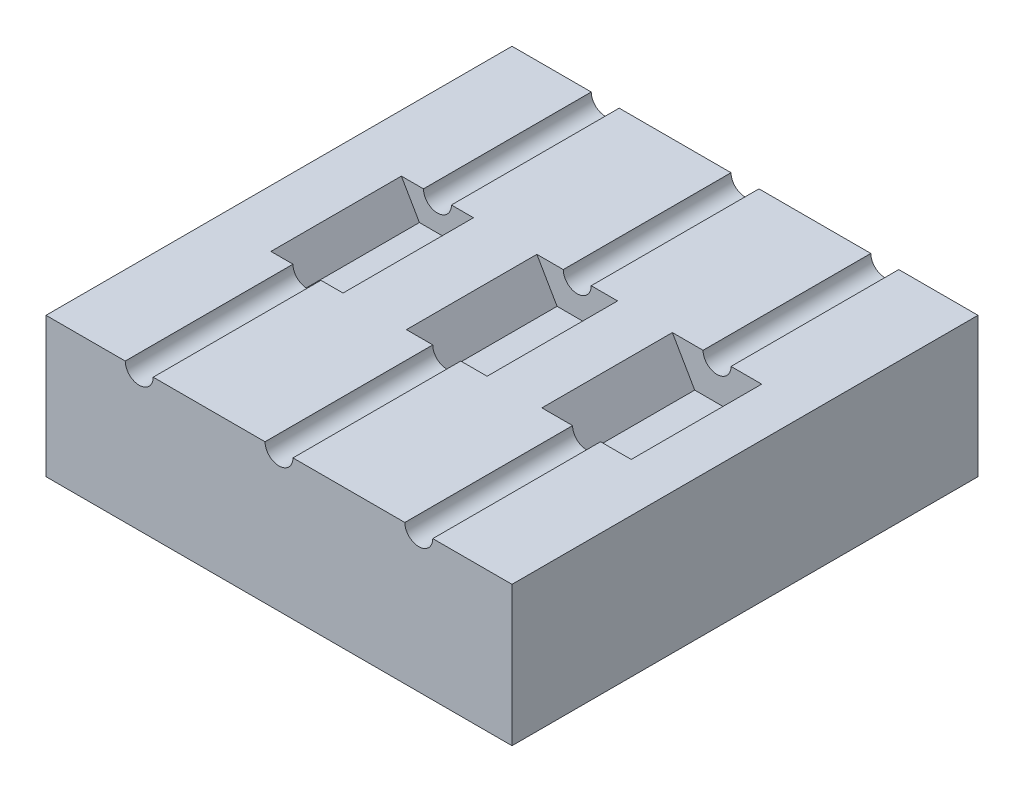
ISO-10303-21;
HEADER;
FILE_DESCRIPTION(('STEP AP214'),'2;1');
FILE_NAME('part.step','',(''),(''),'','','');
FILE_SCHEMA(('AUTOMOTIVE_DESIGN { 1 0 10303 214 1 1 1 1 }'));
ENDSEC;
DATA;
#1=APPLICATION_CONTEXT('core data for automotive mechanical design processes');
#2=APPLICATION_PROTOCOL_DEFINITION('international standard','automotive_design',2000,#1);
#3=PRODUCT_CONTEXT('',#1,'mechanical');
#4=PRODUCT('Part','Part','',(#3));
#5=PRODUCT_RELATED_PRODUCT_CATEGORY('part','',(#4));
#6=PRODUCT_DEFINITION_FORMATION('','',#4);
#7=PRODUCT_DEFINITION_CONTEXT('part definition',#1,'design');
#8=PRODUCT_DEFINITION('design','',#6,#7);
#9=PRODUCT_DEFINITION_SHAPE('','',#8);
#10=(LENGTH_UNIT() NAMED_UNIT(*) SI_UNIT(.MILLI.,.METRE.));
#11=(NAMED_UNIT(*) PLANE_ANGLE_UNIT() SI_UNIT($,.RADIAN.));
#12=(NAMED_UNIT(*) SI_UNIT($,.STERADIAN.) SOLID_ANGLE_UNIT());
#13=UNCERTAINTY_MEASURE_WITH_UNIT(LENGTH_MEASURE(1.E-05),#10,'distance_accuracy_value','');
#14=(GEOMETRIC_REPRESENTATION_CONTEXT(3) GLOBAL_UNCERTAINTY_ASSIGNED_CONTEXT((#13)) GLOBAL_UNIT_ASSIGNED_CONTEXT((#10,
#11,#12)) REPRESENTATION_CONTEXT('',''));
#15=CARTESIAN_POINT('',(0.,0.,0.));
#16=DIRECTION('',(0.,0.,1.));
#17=DIRECTION('',(1.,0.,0.));
#18=AXIS2_PLACEMENT_3D('',#15,#16,#17);
#19=CARTESIAN_POINT('',(0.,7.5,0.));
#20=DIRECTION('',(0.,-1.,0.));
#21=DIRECTION('',(0.,0.,-1.));
#22=AXIS2_PLACEMENT_3D('',#19,#20,#21);
#23=PLANE('',#22);
#24=DIRECTION('',(1.,0.,0.));
#25=VECTOR('',#24,1.);
#26=CARTESIAN_POINT('',(0.,7.5,0.));
#27=LINE('',#26,#25);
#28=CARTESIAN_POINT('',(0.,7.5,0.));
#29=VERTEX_POINT('',#28);
#30=CARTESIAN_POINT('',(4.25,7.5,0.));
#31=VERTEX_POINT('',#30);
#32=EDGE_CURVE('E239',#29,#31,#27,.T.);
#33=ORIENTED_EDGE('',*,*,#32,.T.);
#34=DIRECTION('',(0.,0.,-1.));
#35=VECTOR('',#34,1.);
#36=CARTESIAN_POINT('',(4.25,7.5,0.));
#37=LINE('',#36,#35);
#38=CARTESIAN_POINT('',(4.25,7.5,-9.));
#39=VERTEX_POINT('',#38);
#40=EDGE_CURVE('E221',#31,#39,#37,.T.);
#41=ORIENTED_EDGE('',*,*,#40,.T.);
#42=DIRECTION('',(-1.,0.,0.));
#43=VECTOR('',#42,1.);
#44=CARTESIAN_POINT('',(6.93412340178524,7.5,-9.));
#45=LINE('',#44,#43);
#46=CARTESIAN_POINT('',(3.06587659821476,7.5,-9.));
#47=VERTEX_POINT('',#46);
#48=EDGE_CURVE('E350',#39,#47,#45,.T.);
#49=ORIENTED_EDGE('',*,*,#48,.T.);
#50=DIRECTION('',(0.,0.,-1.));
#51=VECTOR('',#50,1.);
#52=CARTESIAN_POINT('',(3.06587659821476,7.5,-9.));
#53=LINE('',#52,#51);
#54=CARTESIAN_POINT('',(3.06587659821476,7.5,-16.));
#55=VERTEX_POINT('',#54);
#56=EDGE_CURVE('E336',#47,#55,#53,.T.);
#57=ORIENTED_EDGE('',*,*,#56,.T.);
#58=DIRECTION('',(-1.,0.,0.));
#59=VECTOR('',#58,1.);
#60=CARTESIAN_POINT('',(6.93412340178524,7.5,-16.));
#61=LINE('',#60,#59);
#62=CARTESIAN_POINT('',(4.25,7.5,-16.));
#63=VERTEX_POINT('',#62);
#64=EDGE_CURVE('E363',#63,#55,#61,.T.);
#65=ORIENTED_EDGE('',*,*,#64,.F.);
#66=CARTESIAN_POINT('',(4.25,7.5,-25.));
#67=VERTEX_POINT('',#66);
#68=EDGE_CURVE('E234',#63,#67,#37,.T.);
#69=ORIENTED_EDGE('',*,*,#68,.T.);
#70=DIRECTION('',(-1.,0.,0.));
#71=VECTOR('',#70,1.);
#72=CARTESIAN_POINT('',(0.,7.5,-25.));
#73=LINE('',#72,#71);
#74=CARTESIAN_POINT('',(0.,7.5,-25.));
#75=VERTEX_POINT('',#74);
#76=EDGE_CURVE('E252',#67,#75,#73,.T.);
#77=ORIENTED_EDGE('',*,*,#76,.T.);
#78=DIRECTION('',(0.,0.,1.));
#79=VECTOR('',#78,1.);
#80=CARTESIAN_POINT('',(0.,7.5,0.));
#81=LINE('',#80,#79);
#82=EDGE_CURVE('E247',#75,#29,#81,.T.);
#83=ORIENTED_EDGE('',*,*,#82,.T.);
#84=EDGE_LOOP('',(#33,#41,#49,#57,#65,#69,#77,#83));
#85=FACE_BOUND('',#84,.T.);
#86=ADVANCED_FACE('F38',(#85),#23,.F.);
#87=CARTESIAN_POINT('',(13.25,7.5,0.));
#88=VERTEX_POINT('',#87);
#89=CARTESIAN_POINT('',(19.25,7.5,0.));
#90=VERTEX_POINT('',#89);
#91=EDGE_CURVE('E254',#88,#90,#27,.T.);
#92=ORIENTED_EDGE('',*,*,#91,.T.);
#93=DIRECTION('',(0.,0.,-1.));
#94=VECTOR('',#93,1.);
#95=CARTESIAN_POINT('',(19.25,7.5,0.));
#96=LINE('',#95,#94);
#97=CARTESIAN_POINT('',(19.25,7.5,-9.));
#98=VERTEX_POINT('',#97);
#99=EDGE_CURVE('E298',#90,#98,#96,.T.);
#100=ORIENTED_EDGE('',*,*,#99,.T.);
#101=DIRECTION('',(-1.,0.,0.));
#102=VECTOR('',#101,1.);
#103=CARTESIAN_POINT('',(22.3960036171369,7.5,-9.));
#104=LINE('',#103,#102);
#105=CARTESIAN_POINT('',(17.6039963828631,7.5,-9.));
#106=VERTEX_POINT('',#105);
#107=EDGE_CURVE('E283',#98,#106,#104,.T.);
#108=ORIENTED_EDGE('',*,*,#107,.T.);
#109=DIRECTION('',(0.,0.,-1.));
#110=VECTOR('',#109,1.);
#111=CARTESIAN_POINT('',(17.6039963828631,7.5,-9.));
#112=LINE('',#111,#110);
#113=CARTESIAN_POINT('',(17.6039963828631,7.5,-16.));
#114=VERTEX_POINT('',#113);
#115=EDGE_CURVE('E292',#106,#114,#112,.T.);
#116=ORIENTED_EDGE('',*,*,#115,.T.);
#117=DIRECTION('',(-1.,0.,0.));
#118=VECTOR('',#117,1.);
#119=CARTESIAN_POINT('',(22.3960036171369,7.5,-16.));
#120=LINE('',#119,#118);
#121=CARTESIAN_POINT('',(19.25,7.5,-16.));
#122=VERTEX_POINT('',#121);
#123=EDGE_CURVE('E270',#122,#114,#120,.T.);
#124=ORIENTED_EDGE('',*,*,#123,.F.);
#125=CARTESIAN_POINT('',(19.25,7.5,-25.));
#126=VERTEX_POINT('',#125);
#127=EDGE_CURVE('E60',#122,#126,#96,.T.);
#128=ORIENTED_EDGE('',*,*,#127,.T.);
#129=CARTESIAN_POINT('',(13.25,7.5,-25.));
#130=VERTEX_POINT('',#129);
#131=EDGE_CURVE('E437',#126,#130,#73,.T.);
#132=ORIENTED_EDGE('',*,*,#131,.T.);
#133=DIRECTION('',(0.,0.,-1.));
#134=VECTOR('',#133,1.);
#135=CARTESIAN_POINT('',(13.25,7.5,0.));
#136=LINE('',#135,#134);
#137=CARTESIAN_POINT('',(13.25,7.5,-16.));
#138=VERTEX_POINT('',#137);
#139=EDGE_CURVE('E231',#130,#138,#136,.F.);
#140=ORIENTED_EDGE('',*,*,#139,.T.);
#141=DIRECTION('',(-1.,0.,0.));
#142=VECTOR('',#141,1.);
#143=CARTESIAN_POINT('',(14.6650635094611,7.5,-16.));
#144=LINE('',#143,#142);
#145=CARTESIAN_POINT('',(14.6650635094611,7.5,-16.));
#146=VERTEX_POINT('',#145);
#147=EDGE_CURVE('E302',#146,#138,#144,.T.);
#148=ORIENTED_EDGE('',*,*,#147,.F.);
#149=DIRECTION('',(0.,0.,-1.));
#150=VECTOR('',#149,1.);
#151=CARTESIAN_POINT('',(14.6650635094611,7.5,-9.));
#152=LINE('',#151,#150);
#153=CARTESIAN_POINT('',(14.6650635094611,7.5,-9.));
#154=VERTEX_POINT('',#153);
#155=EDGE_CURVE('E266',#154,#146,#152,.T.);
#156=ORIENTED_EDGE('',*,*,#155,.F.);
#157=DIRECTION('',(-1.,0.,0.));
#158=VECTOR('',#157,1.);
#159=CARTESIAN_POINT('',(14.6650635094611,7.5,-9.));
#160=LINE('',#159,#158);
#161=CARTESIAN_POINT('',(13.25,7.5,-9.));
#162=VERTEX_POINT('',#161);
#163=EDGE_CURVE('E315',#154,#162,#160,.T.);
#164=ORIENTED_EDGE('',*,*,#163,.T.);
#165=EDGE_CURVE('E375',#162,#88,#136,.F.);
#166=ORIENTED_EDGE('',*,*,#165,.T.);
#167=EDGE_LOOP('',(#92,#100,#108,#116,#124,#128,#132,#140,#148,#156,#164,#166));
#168=FACE_BOUND('',#167,.T.);
#169=ADVANCED_FACE('F399',(#168),#23,.F.);
#170=CARTESIAN_POINT('',(11.75,7.5,-25.));
#171=VERTEX_POINT('',#170);
#172=CARTESIAN_POINT('',(5.75,7.5,-25.));
#173=VERTEX_POINT('',#172);
#174=EDGE_CURVE('E428',#171,#173,#73,.T.);
#175=ORIENTED_EDGE('',*,*,#174,.T.);
#176=DIRECTION('',(0.,0.,-1.));
#177=VECTOR('',#176,1.);
#178=CARTESIAN_POINT('',(5.75,7.5,0.));
#179=LINE('',#178,#177);
#180=CARTESIAN_POINT('',(5.75,7.5,-16.));
#181=VERTEX_POINT('',#180);
#182=EDGE_CURVE('E383',#173,#181,#179,.F.);
#183=ORIENTED_EDGE('',*,*,#182,.T.);
#184=CARTESIAN_POINT('',(6.93412340178524,7.5,-16.));
#185=VERTEX_POINT('',#184);
#186=EDGE_CURVE('E360',#185,#181,#61,.T.);
#187=ORIENTED_EDGE('',*,*,#186,.F.);
#188=DIRECTION('',(0.,0.,-1.));
#189=VECTOR('',#188,1.);
#190=CARTESIAN_POINT('',(6.93412340178524,7.5,-9.));
#191=LINE('',#190,#189);
#192=CARTESIAN_POINT('',(6.93412340178524,7.5,-9.));
#193=VERTEX_POINT('',#192);
#194=EDGE_CURVE('E332',#193,#185,#191,.T.);
#195=ORIENTED_EDGE('',*,*,#194,.F.);
#196=CARTESIAN_POINT('',(5.75,7.5,-9.));
#197=VERTEX_POINT('',#196);
#198=EDGE_CURVE('E347',#193,#197,#45,.T.);
#199=ORIENTED_EDGE('',*,*,#198,.T.);
#200=CARTESIAN_POINT('',(5.75,7.5,0.));
#201=VERTEX_POINT('',#200);
#202=EDGE_CURVE('E232',#197,#201,#179,.F.);
#203=ORIENTED_EDGE('',*,*,#202,.T.);
#204=CARTESIAN_POINT('',(11.75,7.5,0.));
#205=VERTEX_POINT('',#204);
#206=EDGE_CURVE('E243',#201,#205,#27,.T.);
#207=ORIENTED_EDGE('',*,*,#206,.T.);
#208=DIRECTION('',(0.,0.,-1.));
#209=VECTOR('',#208,1.);
#210=CARTESIAN_POINT('',(11.75,7.5,0.));
#211=LINE('',#210,#209);
#212=CARTESIAN_POINT('',(11.75,7.5,-9.));
#213=VERTEX_POINT('',#212);
#214=EDGE_CURVE('E371',#205,#213,#211,.T.);
#215=ORIENTED_EDGE('',*,*,#214,.T.);
#216=CARTESIAN_POINT('',(10.3349364905389,7.5,-9.));
#217=VERTEX_POINT('',#216);
#218=EDGE_CURVE('E318',#213,#217,#160,.T.);
#219=ORIENTED_EDGE('',*,*,#218,.T.);
#220=DIRECTION('',(0.,0.,-1.));
#221=VECTOR('',#220,1.);
#222=CARTESIAN_POINT('',(10.3349364905389,7.5,-9.));
#223=LINE('',#222,#221);
#224=CARTESIAN_POINT('',(10.3349364905389,7.5,-16.));
#225=VERTEX_POINT('',#224);
#226=EDGE_CURVE('E327',#217,#225,#223,.T.);
#227=ORIENTED_EDGE('',*,*,#226,.T.);
#228=CARTESIAN_POINT('',(11.75,7.5,-16.));
#229=VERTEX_POINT('',#228);
#230=EDGE_CURVE('E305',#229,#225,#144,.T.);
#231=ORIENTED_EDGE('',*,*,#230,.F.);
#232=EDGE_CURVE('E376',#229,#171,#211,.T.);
#233=ORIENTED_EDGE('',*,*,#232,.T.);
#234=EDGE_LOOP('',(#175,#183,#187,#195,#199,#203,#207,#215,#219,#227,#231,#233));
#235=FACE_BOUND('',#234,.T.);
#236=ADVANCED_FACE('F407',(#235),#23,.F.);
#237=CARTESIAN_POINT('',(0.,7.5,0.));
#238=DIRECTION('',(1.,0.,0.));
#239=DIRECTION('',(0.,0.,-1.));
#240=AXIS2_PLACEMENT_3D('',#237,#238,#239);
#241=PLANE('',#240);
#242=DIRECTION('',(0.,0.,1.));
#243=VECTOR('',#242,1.);
#244=CARTESIAN_POINT('',(0.,0.,0.));
#245=LINE('',#244,#243);
#246=CARTESIAN_POINT('',(0.,0.,-25.));
#247=VERTEX_POINT('',#246);
#248=CARTESIAN_POINT('',(0.,0.,0.));
#249=VERTEX_POINT('',#248);
#250=EDGE_CURVE('E335',#247,#249,#245,.T.);
#251=ORIENTED_EDGE('',*,*,#250,.T.);
#252=DIRECTION('',(0.,-1.,0.));
#253=VECTOR('',#252,1.);
#254=CARTESIAN_POINT('',(0.,7.5,0.));
#255=LINE('',#254,#253);
#256=EDGE_CURVE('E456',#29,#249,#255,.T.);
#257=ORIENTED_EDGE('',*,*,#256,.F.);
#258=ORIENTED_EDGE('',*,*,#82,.F.);
#259=DIRECTION('',(0.,-1.,0.));
#260=VECTOR('',#259,1.);
#261=CARTESIAN_POINT('',(0.,7.5,-25.));
#262=LINE('',#261,#260);
#263=EDGE_CURVE('E442',#75,#247,#262,.T.);
#264=ORIENTED_EDGE('',*,*,#263,.T.);
#265=EDGE_LOOP('',(#251,#257,#258,#264));
#266=FACE_BOUND('',#265,.T.);
#267=ADVANCED_FACE('F40',(#266),#241,.F.);
#268=CARTESIAN_POINT('',(0.,7.5,0.));
#269=DIRECTION('',(0.,0.,-1.));
#270=DIRECTION('',(-1.,0.,0.));
#271=AXIS2_PLACEMENT_3D('',#268,#269,#270);
#272=PLANE('',#271);
#273=ORIENTED_EDGE('',*,*,#206,.F.);
#274=CARTESIAN_POINT('',(5.,7.5,0.));
#275=DIRECTION('',(0.,0.,-1.));
#276=DIRECTION('',(-1.,0.,0.));
#277=AXIS2_PLACEMENT_3D('',#274,#275,#276);
#278=CIRCLE('',#277,0.749999999999999);
#279=EDGE_CURVE('E224',#201,#31,#278,.T.);
#280=ORIENTED_EDGE('',*,*,#279,.T.);
#281=ORIENTED_EDGE('',*,*,#32,.F.);
#282=ORIENTED_EDGE('',*,*,#256,.T.);
#283=DIRECTION('',(1.,0.,0.));
#284=VECTOR('',#283,1.);
#285=CARTESIAN_POINT('',(0.,0.,0.));
#286=LINE('',#285,#284);
#287=CARTESIAN_POINT('',(25.,0.,0.));
#288=VERTEX_POINT('',#287);
#289=EDGE_CURVE('E445',#249,#288,#286,.T.);
#290=ORIENTED_EDGE('',*,*,#289,.T.);
#291=DIRECTION('',(0.,-1.,0.));
#292=VECTOR('',#291,1.);
#293=CARTESIAN_POINT('',(25.,7.5,0.));
#294=LINE('',#293,#292);
#295=CARTESIAN_POINT('',(25.,7.5,0.));
#296=VERTEX_POINT('',#295);
#297=EDGE_CURVE('E453',#296,#288,#294,.T.);
#298=ORIENTED_EDGE('',*,*,#297,.F.);
#299=CARTESIAN_POINT('',(20.75,7.5,0.));
#300=VERTEX_POINT('',#299);
#301=EDGE_CURVE('E251',#300,#296,#27,.T.);
#302=ORIENTED_EDGE('',*,*,#301,.F.);
#303=CARTESIAN_POINT('',(20.,7.5,0.));
#304=DIRECTION('',(0.,0.,-1.));
#305=DIRECTION('',(-1.,0.,0.));
#306=AXIS2_PLACEMENT_3D('',#303,#304,#305);
#307=CIRCLE('',#306,0.750000000000002);
#308=EDGE_CURVE('E391',#300,#90,#307,.T.);
#309=ORIENTED_EDGE('',*,*,#308,.T.);
#310=ORIENTED_EDGE('',*,*,#91,.F.);
#311=CARTESIAN_POINT('',(12.5,7.5,0.));
#312=DIRECTION('',(0.,0.,-1.));
#313=DIRECTION('',(-1.,0.,0.));
#314=AXIS2_PLACEMENT_3D('',#311,#312,#313);
#315=CIRCLE('',#314,0.75);
#316=EDGE_CURVE('E386',#88,#205,#315,.T.);
#317=ORIENTED_EDGE('',*,*,#316,.T.);
#318=EDGE_LOOP('',(#273,#280,#281,#282,#290,#298,#302,#309,#310,#317));
#319=FACE_BOUND('',#318,.T.);
#320=ADVANCED_FACE('F237',(#319),#272,.F.);
#321=CARTESIAN_POINT('',(25.,7.5,0.));
#322=DIRECTION('',(-1.,0.,0.));
#323=DIRECTION('',(0.,0.,1.));
#324=AXIS2_PLACEMENT_3D('',#321,#322,#323);
#325=PLANE('',#324);
#326=DIRECTION('',(0.,0.,-1.));
#327=VECTOR('',#326,1.);
#328=CARTESIAN_POINT('',(25.,0.,0.));
#329=LINE('',#328,#327);
#330=CARTESIAN_POINT('',(25.,0.,-25.));
#331=VERTEX_POINT('',#330);
#332=EDGE_CURVE('E261',#288,#331,#329,.T.);
#333=ORIENTED_EDGE('',*,*,#332,.T.);
#334=DIRECTION('',(0.,-1.,0.));
#335=VECTOR('',#334,1.);
#336=CARTESIAN_POINT('',(25.,7.5,-25.));
#337=LINE('',#336,#335);
#338=CARTESIAN_POINT('',(25.,7.5,-25.));
#339=VERTEX_POINT('',#338);
#340=EDGE_CURVE('E450',#339,#331,#337,.T.);
#341=ORIENTED_EDGE('',*,*,#340,.F.);
#342=DIRECTION('',(0.,0.,-1.));
#343=VECTOR('',#342,1.);
#344=CARTESIAN_POINT('',(25.,7.5,0.));
#345=LINE('',#344,#343);
#346=EDGE_CURVE('E249',#296,#339,#345,.T.);
#347=ORIENTED_EDGE('',*,*,#346,.F.);
#348=ORIENTED_EDGE('',*,*,#297,.T.);
#349=EDGE_LOOP('',(#333,#341,#347,#348));
#350=FACE_BOUND('',#349,.T.);
#351=ADVANCED_FACE('F469',(#350),#325,.F.);
#352=CARTESIAN_POINT('',(0.,7.5,-25.));
#353=DIRECTION('',(0.,0.,1.));
#354=DIRECTION('',(1.,0.,0.));
#355=AXIS2_PLACEMENT_3D('',#352,#353,#354);
#356=PLANE('',#355);
#357=ORIENTED_EDGE('',*,*,#76,.F.);
#358=CARTESIAN_POINT('',(5.,7.5,-25.));
#359=DIRECTION('',(0.,0.,-1.));
#360=DIRECTION('',(-1.,0.,0.));
#361=AXIS2_PLACEMENT_3D('',#358,#359,#360);
#362=CIRCLE('',#361,0.749999999999999);
#363=EDGE_CURVE('E244',#173,#67,#362,.T.);
#364=ORIENTED_EDGE('',*,*,#363,.F.);
#365=ORIENTED_EDGE('',*,*,#174,.F.);
#366=CARTESIAN_POINT('',(12.5,7.5,-25.));
#367=DIRECTION('',(0.,0.,-1.));
#368=DIRECTION('',(-1.,0.,0.));
#369=AXIS2_PLACEMENT_3D('',#366,#367,#368);
#370=CIRCLE('',#369,0.75);
#371=EDGE_CURVE('E388',#130,#171,#370,.T.);
#372=ORIENTED_EDGE('',*,*,#371,.F.);
#373=ORIENTED_EDGE('',*,*,#131,.F.);
#374=CARTESIAN_POINT('',(20.,7.5,-25.));
#375=DIRECTION('',(0.,0.,-1.));
#376=DIRECTION('',(-1.,0.,0.));
#377=AXIS2_PLACEMENT_3D('',#374,#375,#376);
#378=CIRCLE('',#377,0.750000000000002);
#379=CARTESIAN_POINT('',(20.75,7.5,-25.));
#380=VERTEX_POINT('',#379);
#381=EDGE_CURVE('E390',#380,#126,#378,.T.);
#382=ORIENTED_EDGE('',*,*,#381,.F.);
#383=EDGE_CURVE('E439',#339,#380,#73,.T.);
#384=ORIENTED_EDGE('',*,*,#383,.F.);
#385=ORIENTED_EDGE('',*,*,#340,.T.);
#386=DIRECTION('',(-1.,0.,0.));
#387=VECTOR('',#386,1.);
#388=CARTESIAN_POINT('',(0.,0.,-25.));
#389=LINE('',#388,#387);
#390=EDGE_CURVE('E260',#331,#247,#389,.T.);
#391=ORIENTED_EDGE('',*,*,#390,.T.);
#392=ORIENTED_EDGE('',*,*,#263,.F.);
#393=EDGE_LOOP('',(#357,#364,#365,#372,#373,#382,#384,#385,#391,#392));
#394=FACE_BOUND('',#393,.T.);
#395=ADVANCED_FACE('F434',(#394),#356,.F.);
#396=ORIENTED_EDGE('',*,*,#383,.T.);
#397=DIRECTION('',(0.,0.,-1.));
#398=VECTOR('',#397,1.);
#399=CARTESIAN_POINT('',(20.75,7.5,0.));
#400=LINE('',#399,#398);
#401=CARTESIAN_POINT('',(20.75,7.5,-16.));
#402=VERTEX_POINT('',#401);
#403=EDGE_CURVE('E368',#380,#402,#400,.F.);
#404=ORIENTED_EDGE('',*,*,#403,.T.);
#405=CARTESIAN_POINT('',(22.3960036171369,7.5,-16.));
#406=VERTEX_POINT('',#405);
#407=EDGE_CURVE('E267',#406,#402,#120,.T.);
#408=ORIENTED_EDGE('',*,*,#407,.F.);
#409=DIRECTION('',(0.,0.,-1.));
#410=VECTOR('',#409,1.);
#411=CARTESIAN_POINT('',(22.3960036171369,7.5,-9.));
#412=LINE('',#411,#410);
#413=CARTESIAN_POINT('',(22.3960036171369,7.5,-9.));
#414=VERTEX_POINT('',#413);
#415=EDGE_CURVE('E295',#414,#406,#412,.T.);
#416=ORIENTED_EDGE('',*,*,#415,.F.);
#417=CARTESIAN_POINT('',(20.75,7.5,-9.));
#418=VERTEX_POINT('',#417);
#419=EDGE_CURVE('E280',#414,#418,#104,.T.);
#420=ORIENTED_EDGE('',*,*,#419,.T.);
#421=EDGE_CURVE('E53',#418,#300,#400,.F.);
#422=ORIENTED_EDGE('',*,*,#421,.T.);
#423=ORIENTED_EDGE('',*,*,#301,.T.);
#424=ORIENTED_EDGE('',*,*,#346,.T.);
#425=EDGE_LOOP('',(#396,#404,#408,#416,#420,#422,#423,#424));
#426=FACE_BOUND('',#425,.T.);
#427=ADVANCED_FACE('F464',(#426),#23,.F.);
#428=CARTESIAN_POINT('',(0.,0.,0.));
#429=DIRECTION('',(0.,-1.,0.));
#430=DIRECTION('',(0.,0.,-1.));
#431=AXIS2_PLACEMENT_3D('',#428,#429,#430);
#432=PLANE('',#431);
#433=ORIENTED_EDGE('',*,*,#250,.F.);
#434=ORIENTED_EDGE('',*,*,#390,.F.);
#435=ORIENTED_EDGE('',*,*,#332,.F.);
#436=ORIENTED_EDGE('',*,*,#289,.F.);
#437=EDGE_LOOP('',(#433,#434,#435,#436));
#438=FACE_BOUND('',#437,.T.);
#439=ADVANCED_FACE('F475',(#438),#432,.T.);
#440=CARTESIAN_POINT('',(21.1980018085685,5.425,-9.));
#441=DIRECTION('',(-0.86602540378444,0.499999999999998,0.));
#442=DIRECTION('',(-0.499999999999998,-0.86602540378444,0.));
#443=AXIS2_PLACEMENT_3D('',#440,#441,#442);
#444=PLANE('',#443);
#445=DIRECTION('',(0.,0.,-1.));
#446=VECTOR('',#445,1.);
#447=CARTESIAN_POINT('',(21.1980018085685,5.425,-9.));
#448=LINE('',#447,#446);
#449=CARTESIAN_POINT('',(21.1980018085685,5.425,-9.));
#450=VERTEX_POINT('',#449);
#451=CARTESIAN_POINT('',(21.1980018085685,5.425,-16.));
#452=VERTEX_POINT('',#451);
#453=EDGE_CURVE('E288',#450,#452,#448,.T.);
#454=ORIENTED_EDGE('',*,*,#453,.F.);
#455=DIRECTION('',(0.499999999999998,0.86602540378444,0.));
#456=VECTOR('',#455,1.);
#457=CARTESIAN_POINT('',(21.1980018085685,5.425,-9.));
#458=LINE('',#457,#456);
#459=EDGE_CURVE('E277',#450,#414,#458,.T.);
#460=ORIENTED_EDGE('',*,*,#459,.T.);
#461=ORIENTED_EDGE('',*,*,#415,.T.);
#462=DIRECTION('',(0.499999999999998,0.86602540378444,0.));
#463=VECTOR('',#462,1.);
#464=CARTESIAN_POINT('',(21.1980018085685,5.425,-16.));
#465=LINE('',#464,#463);
#466=EDGE_CURVE('E264',#452,#406,#465,.T.);
#467=ORIENTED_EDGE('',*,*,#466,.F.);
#468=EDGE_LOOP('',(#454,#460,#461,#467));
#469=FACE_BOUND('',#468,.T.);
#470=ADVANCED_FACE('F523',(#469),#444,.T.);
#471=CARTESIAN_POINT('',(18.8019981914315,5.425,-9.));
#472=DIRECTION('',(0.866025403784439,0.499999999999999,0.));
#473=DIRECTION('',(-0.499999999999999,0.866025403784439,0.));
#474=AXIS2_PLACEMENT_3D('',#471,#472,#473);
#475=PLANE('',#474);
#476=ORIENTED_EDGE('',*,*,#115,.F.);
#477=DIRECTION('',(0.499999999999999,-0.866025403784439,0.));
#478=VECTOR('',#477,1.);
#479=CARTESIAN_POINT('',(18.8019981914315,5.425,-9.));
#480=LINE('',#479,#478);
#481=CARTESIAN_POINT('',(18.8019981914315,5.425,-9.));
#482=VERTEX_POINT('',#481);
#483=EDGE_CURVE('E284',#106,#482,#480,.T.);
#484=ORIENTED_EDGE('',*,*,#483,.T.);
#485=DIRECTION('',(0.,0.,-1.));
#486=VECTOR('',#485,1.);
#487=CARTESIAN_POINT('',(18.8019981914315,5.425,-9.));
#488=LINE('',#487,#486);
#489=CARTESIAN_POINT('',(18.8019981914315,5.425,-16.));
#490=VERTEX_POINT('',#489);
#491=EDGE_CURVE('E290',#482,#490,#488,.T.);
#492=ORIENTED_EDGE('',*,*,#491,.T.);
#493=DIRECTION('',(0.499999999999999,-0.866025403784439,0.));
#494=VECTOR('',#493,1.);
#495=CARTESIAN_POINT('',(18.8019981914315,5.425,-16.));
#496=LINE('',#495,#494);
#497=EDGE_CURVE('E271',#114,#490,#496,.T.);
#498=ORIENTED_EDGE('',*,*,#497,.F.);
#499=EDGE_LOOP('',(#476,#484,#492,#498));
#500=FACE_BOUND('',#499,.T.);
#501=ADVANCED_FACE('F551',(#500),#475,.T.);
#502=CARTESIAN_POINT('',(18.8019981914315,5.425,-9.));
#503=DIRECTION('',(0.,1.,0.));
#504=DIRECTION('',(-1.,0.,0.));
#505=AXIS2_PLACEMENT_3D('',#502,#503,#504);
#506=PLANE('',#505);
#507=ORIENTED_EDGE('',*,*,#491,.F.);
#508=DIRECTION('',(1.,0.,0.));
#509=VECTOR('',#508,1.);
#510=CARTESIAN_POINT('',(18.8019981914315,5.425,-9.));
#511=LINE('',#510,#509);
#512=EDGE_CURVE('E286',#482,#450,#511,.T.);
#513=ORIENTED_EDGE('',*,*,#512,.T.);
#514=ORIENTED_EDGE('',*,*,#453,.T.);
#515=DIRECTION('',(1.,0.,0.));
#516=VECTOR('',#515,1.);
#517=CARTESIAN_POINT('',(18.8019981914315,5.425,-16.));
#518=LINE('',#517,#516);
#519=EDGE_CURVE('E274',#490,#452,#518,.T.);
#520=ORIENTED_EDGE('',*,*,#519,.F.);
#521=EDGE_LOOP('',(#507,#513,#514,#520));
#522=FACE_BOUND('',#521,.T.);
#523=ADVANCED_FACE('F560',(#522),#506,.T.);
#524=CARTESIAN_POINT('',(0.,0.,-9.));
#525=DIRECTION('',(0.,0.,1.));
#526=DIRECTION('',(1.,0.,0.));
#527=AXIS2_PLACEMENT_3D('',#524,#525,#526);
#528=PLANE('',#527);
#529=ORIENTED_EDGE('',*,*,#107,.F.);
#530=CARTESIAN_POINT('',(20.,7.5,-9.));
#531=DIRECTION('',(0.,0.,1.));
#532=DIRECTION('',(1.,0.,0.));
#533=AXIS2_PLACEMENT_3D('',#530,#531,#532);
#534=CIRCLE('',#533,0.750000000000002);
#535=EDGE_CURVE('E365',#98,#418,#534,.T.);
#536=ORIENTED_EDGE('',*,*,#535,.T.);
#537=ORIENTED_EDGE('',*,*,#419,.F.);
#538=ORIENTED_EDGE('',*,*,#459,.F.);
#539=ORIENTED_EDGE('',*,*,#512,.F.);
#540=ORIENTED_EDGE('',*,*,#483,.F.);
#541=EDGE_LOOP('',(#529,#536,#537,#538,#539,#540));
#542=FACE_BOUND('',#541,.T.);
#543=ADVANCED_FACE('F569',(#542),#528,.F.);
#544=CARTESIAN_POINT('',(0.,0.,-16.));
#545=DIRECTION('',(0.,0.,1.));
#546=DIRECTION('',(1.,0.,0.));
#547=AXIS2_PLACEMENT_3D('',#544,#545,#546);
#548=PLANE('',#547);
#549=CARTESIAN_POINT('',(20.,7.5,-16.));
#550=DIRECTION('',(0.,0.,1.));
#551=DIRECTION('',(1.,0.,0.));
#552=AXIS2_PLACEMENT_3D('',#549,#550,#551);
#553=CIRCLE('',#552,0.750000000000002);
#554=EDGE_CURVE('E11',#122,#402,#553,.T.);
#555=ORIENTED_EDGE('',*,*,#554,.F.);
#556=ORIENTED_EDGE('',*,*,#123,.T.);
#557=ORIENTED_EDGE('',*,*,#497,.T.);
#558=ORIENTED_EDGE('',*,*,#519,.T.);
#559=ORIENTED_EDGE('',*,*,#466,.T.);
#560=ORIENTED_EDGE('',*,*,#407,.T.);
#561=EDGE_LOOP('',(#555,#556,#557,#558,#559,#560));
#562=FACE_BOUND('',#561,.T.);
#563=ADVANCED_FACE('F580',(#562),#548,.T.);
#564=CARTESIAN_POINT('',(13.5825317547305,5.625,-9.));
#565=DIRECTION('',(-0.86602540378444,0.499999999999998,0.));
#566=DIRECTION('',(-0.499999999999998,-0.86602540378444,0.));
#567=AXIS2_PLACEMENT_3D('',#564,#565,#566);
#568=PLANE('',#567);
#569=DIRECTION('',(0.,0.,-1.));
#570=VECTOR('',#569,1.);
#571=CARTESIAN_POINT('',(13.5825317547305,5.625,-9.));
#572=LINE('',#571,#570);
#573=CARTESIAN_POINT('',(13.5825317547305,5.625,-9.));
#574=VERTEX_POINT('',#573);
#575=CARTESIAN_POINT('',(13.5825317547305,5.625,-16.));
#576=VERTEX_POINT('',#575);
#577=EDGE_CURVE('E323',#574,#576,#572,.T.);
#578=ORIENTED_EDGE('',*,*,#577,.F.);
#579=DIRECTION('',(0.499999999999998,0.86602540378444,0.));
#580=VECTOR('',#579,1.);
#581=CARTESIAN_POINT('',(13.5825317547305,5.625,-9.));
#582=LINE('',#581,#580);
#583=EDGE_CURVE('E312',#574,#154,#582,.T.);
#584=ORIENTED_EDGE('',*,*,#583,.T.);
#585=ORIENTED_EDGE('',*,*,#155,.T.);
#586=DIRECTION('',(0.499999999999998,0.86602540378444,0.));
#587=VECTOR('',#586,1.);
#588=CARTESIAN_POINT('',(13.5825317547305,5.625,-16.));
#589=LINE('',#588,#587);
#590=EDGE_CURVE('E299',#576,#146,#589,.T.);
#591=ORIENTED_EDGE('',*,*,#590,.F.);
#592=EDGE_LOOP('',(#578,#584,#585,#591));
#593=FACE_BOUND('',#592,.T.);
#594=ADVANCED_FACE('F576',(#593),#568,.T.);
#595=CARTESIAN_POINT('',(11.4174682452695,5.625,-9.));
#596=DIRECTION('',(0.86602540378444,0.499999999999998,0.));
#597=DIRECTION('',(-0.499999999999998,0.86602540378444,0.));
#598=AXIS2_PLACEMENT_3D('',#595,#596,#597);
#599=PLANE('',#598);
#600=ORIENTED_EDGE('',*,*,#226,.F.);
#601=DIRECTION('',(0.499999999999998,-0.86602540378444,0.));
#602=VECTOR('',#601,1.);
#603=CARTESIAN_POINT('',(11.4174682452695,5.625,-9.));
#604=LINE('',#603,#602);
#605=CARTESIAN_POINT('',(11.4174682452695,5.625,-9.));
#606=VERTEX_POINT('',#605);
#607=EDGE_CURVE('E319',#217,#606,#604,.T.);
#608=ORIENTED_EDGE('',*,*,#607,.T.);
#609=DIRECTION('',(0.,0.,-1.));
#610=VECTOR('',#609,1.);
#611=CARTESIAN_POINT('',(11.4174682452695,5.625,-9.));
#612=LINE('',#611,#610);
#613=CARTESIAN_POINT('',(11.4174682452695,5.625,-16.));
#614=VERTEX_POINT('',#613);
#615=EDGE_CURVE('E325',#606,#614,#612,.T.);
#616=ORIENTED_EDGE('',*,*,#615,.T.);
#617=DIRECTION('',(0.499999999999998,-0.86602540378444,0.));
#618=VECTOR('',#617,1.);
#619=CARTESIAN_POINT('',(11.4174682452695,5.625,-16.));
#620=LINE('',#619,#618);
#621=EDGE_CURVE('E306',#225,#614,#620,.T.);
#622=ORIENTED_EDGE('',*,*,#621,.F.);
#623=EDGE_LOOP('',(#600,#608,#616,#622));
#624=FACE_BOUND('',#623,.T.);
#625=ADVANCED_FACE('F416',(#624),#599,.T.);
#626=CARTESIAN_POINT('',(11.4174682452695,5.625,-9.));
#627=DIRECTION('',(0.,1.,0.));
#628=DIRECTION('',(0.,0.,1.));
#629=AXIS2_PLACEMENT_3D('',#626,#627,#628);
#630=PLANE('',#629);
#631=ORIENTED_EDGE('',*,*,#615,.F.);
#632=DIRECTION('',(1.,0.,0.));
#633=VECTOR('',#632,1.);
#634=CARTESIAN_POINT('',(11.4174682452695,5.625,-9.));
#635=LINE('',#634,#633);
#636=EDGE_CURVE('E321',#606,#574,#635,.T.);
#637=ORIENTED_EDGE('',*,*,#636,.T.);
#638=ORIENTED_EDGE('',*,*,#577,.T.);
#639=DIRECTION('',(1.,0.,0.));
#640=VECTOR('',#639,1.);
#641=CARTESIAN_POINT('',(11.4174682452695,5.625,-16.));
#642=LINE('',#641,#640);
#643=EDGE_CURVE('E309',#614,#576,#642,.T.);
#644=ORIENTED_EDGE('',*,*,#643,.F.);
#645=EDGE_LOOP('',(#631,#637,#638,#644));
#646=FACE_BOUND('',#645,.T.);
#647=ADVANCED_FACE('F420',(#646),#630,.T.);
#648=CARTESIAN_POINT('',(0.,0.,-9.));
#649=DIRECTION('',(0.,0.,1.));
#650=DIRECTION('',(1.,0.,0.));
#651=AXIS2_PLACEMENT_3D('',#648,#649,#650);
#652=PLANE('',#651);
#653=ORIENTED_EDGE('',*,*,#218,.F.);
#654=CARTESIAN_POINT('',(12.5,7.5,-9.));
#655=DIRECTION('',(0.,0.,1.));
#656=DIRECTION('',(1.,0.,0.));
#657=AXIS2_PLACEMENT_3D('',#654,#655,#656);
#658=CIRCLE('',#657,0.75);
#659=EDGE_CURVE('E372',#213,#162,#658,.T.);
#660=ORIENTED_EDGE('',*,*,#659,.T.);
#661=ORIENTED_EDGE('',*,*,#163,.F.);
#662=ORIENTED_EDGE('',*,*,#583,.F.);
#663=ORIENTED_EDGE('',*,*,#636,.F.);
#664=ORIENTED_EDGE('',*,*,#607,.F.);
#665=EDGE_LOOP('',(#653,#660,#661,#662,#663,#664));
#666=FACE_BOUND('',#665,.T.);
#667=ADVANCED_FACE('F411',(#666),#652,.F.);
#668=CARTESIAN_POINT('',(0.,0.,-16.));
#669=DIRECTION('',(0.,0.,1.));
#670=DIRECTION('',(1.,0.,0.));
#671=AXIS2_PLACEMENT_3D('',#668,#669,#670);
#672=PLANE('',#671);
#673=CARTESIAN_POINT('',(12.5,7.5,-16.));
#674=DIRECTION('',(0.,0.,1.));
#675=DIRECTION('',(1.,0.,0.));
#676=AXIS2_PLACEMENT_3D('',#673,#674,#675);
#677=CIRCLE('',#676,0.75);
#678=EDGE_CURVE('E46',#229,#138,#677,.T.);
#679=ORIENTED_EDGE('',*,*,#678,.F.);
#680=ORIENTED_EDGE('',*,*,#230,.T.);
#681=ORIENTED_EDGE('',*,*,#621,.T.);
#682=ORIENTED_EDGE('',*,*,#643,.T.);
#683=ORIENTED_EDGE('',*,*,#590,.T.);
#684=ORIENTED_EDGE('',*,*,#147,.T.);
#685=EDGE_LOOP('',(#679,#680,#681,#682,#683,#684));
#686=FACE_BOUND('',#685,.T.);
#687=ADVANCED_FACE('F425',(#686),#672,.T.);
#688=CARTESIAN_POINT('',(5.96706170089262,5.825,-9.));
#689=DIRECTION('',(-0.86602540378444,0.499999999999998,0.));
#690=DIRECTION('',(-0.499999999999998,-0.86602540378444,0.));
#691=AXIS2_PLACEMENT_3D('',#688,#689,#690);
#692=PLANE('',#691);
#693=DIRECTION('',(0.,0.,-1.));
#694=VECTOR('',#693,1.);
#695=CARTESIAN_POINT('',(5.96706170089262,5.825,-9.));
#696=LINE('',#695,#694);
#697=CARTESIAN_POINT('',(5.96706170089262,5.825,-9.));
#698=VERTEX_POINT('',#697);
#699=CARTESIAN_POINT('',(5.96706170089262,5.825,-16.));
#700=VERTEX_POINT('',#699);
#701=EDGE_CURVE('E341',#698,#700,#696,.T.);
#702=ORIENTED_EDGE('',*,*,#701,.F.);
#703=DIRECTION('',(0.499999999999998,0.86602540378444,0.));
#704=VECTOR('',#703,1.);
#705=CARTESIAN_POINT('',(5.96706170089262,5.825,-9.));
#706=LINE('',#705,#704);
#707=EDGE_CURVE('E351',#698,#193,#706,.T.);
#708=ORIENTED_EDGE('',*,*,#707,.T.);
#709=ORIENTED_EDGE('',*,*,#194,.T.);
#710=DIRECTION('',(0.499999999999998,0.86602540378444,0.));
#711=VECTOR('',#710,1.);
#712=CARTESIAN_POINT('',(5.96706170089262,5.825,-16.));
#713=LINE('',#712,#711);
#714=EDGE_CURVE('E301',#700,#185,#713,.T.);
#715=ORIENTED_EDGE('',*,*,#714,.F.);
#716=EDGE_LOOP('',(#702,#708,#709,#715));
#717=FACE_BOUND('',#716,.T.);
#718=ADVANCED_FACE('F489',(#717),#692,.T.);
#719=CARTESIAN_POINT('',(4.03293829910738,5.825,-9.));
#720=DIRECTION('',(0.86602540378444,0.499999999999998,0.));
#721=DIRECTION('',(-0.499999999999998,0.86602540378444,0.));
#722=AXIS2_PLACEMENT_3D('',#719,#720,#721);
#723=PLANE('',#722);
#724=ORIENTED_EDGE('',*,*,#56,.F.);
#725=DIRECTION('',(0.499999999999998,-0.86602540378444,0.));
#726=VECTOR('',#725,1.);
#727=CARTESIAN_POINT('',(4.03293829910738,5.825,-9.));
#728=LINE('',#727,#726);
#729=CARTESIAN_POINT('',(4.03293829910738,5.825,-9.));
#730=VERTEX_POINT('',#729);
#731=EDGE_CURVE('E345',#47,#730,#728,.T.);
#732=ORIENTED_EDGE('',*,*,#731,.T.);
#733=DIRECTION('',(0.,0.,-1.));
#734=VECTOR('',#733,1.);
#735=CARTESIAN_POINT('',(4.03293829910738,5.825,-9.));
#736=LINE('',#735,#734);
#737=CARTESIAN_POINT('',(4.03293829910738,5.825,-16.));
#738=VERTEX_POINT('',#737);
#739=EDGE_CURVE('E339',#730,#738,#736,.T.);
#740=ORIENTED_EDGE('',*,*,#739,.T.);
#741=DIRECTION('',(0.499999999999998,-0.86602540378444,0.));
#742=VECTOR('',#741,1.);
#743=CARTESIAN_POINT('',(4.03293829910738,5.825,-16.));
#744=LINE('',#743,#742);
#745=EDGE_CURVE('E357',#55,#738,#744,.T.);
#746=ORIENTED_EDGE('',*,*,#745,.F.);
#747=EDGE_LOOP('',(#724,#732,#740,#746));
#748=FACE_BOUND('',#747,.T.);
#749=ADVANCED_FACE('F497',(#748),#723,.T.);
#750=CARTESIAN_POINT('',(4.03293829910738,5.825,-9.));
#751=DIRECTION('',(0.,1.,0.));
#752=DIRECTION('',(0.,0.,1.));
#753=AXIS2_PLACEMENT_3D('',#750,#751,#752);
#754=PLANE('',#753);
#755=ORIENTED_EDGE('',*,*,#739,.F.);
#756=DIRECTION('',(1.,0.,0.));
#757=VECTOR('',#756,1.);
#758=CARTESIAN_POINT('',(4.03293829910738,5.825,-9.));
#759=LINE('',#758,#757);
#760=EDGE_CURVE('E343',#730,#698,#759,.T.);
#761=ORIENTED_EDGE('',*,*,#760,.T.);
#762=ORIENTED_EDGE('',*,*,#701,.T.);
#763=DIRECTION('',(1.,0.,0.));
#764=VECTOR('',#763,1.);
#765=CARTESIAN_POINT('',(4.03293829910738,5.825,-16.));
#766=LINE('',#765,#764);
#767=EDGE_CURVE('E354',#738,#700,#766,.T.);
#768=ORIENTED_EDGE('',*,*,#767,.F.);
#769=EDGE_LOOP('',(#755,#761,#762,#768));
#770=FACE_BOUND('',#769,.T.);
#771=ADVANCED_FACE('F501',(#770),#754,.T.);
#772=CARTESIAN_POINT('',(0.,0.,-9.));
#773=DIRECTION('',(0.,0.,1.));
#774=DIRECTION('',(1.,0.,0.));
#775=AXIS2_PLACEMENT_3D('',#772,#773,#774);
#776=PLANE('',#775);
#777=ORIENTED_EDGE('',*,*,#48,.F.);
#778=CARTESIAN_POINT('',(5.,7.5,-9.));
#779=DIRECTION('',(0.,0.,1.));
#780=DIRECTION('',(1.,0.,0.));
#781=AXIS2_PLACEMENT_3D('',#778,#779,#780);
#782=CIRCLE('',#781,0.749999999999999);
#783=EDGE_CURVE('E227',#39,#197,#782,.T.);
#784=ORIENTED_EDGE('',*,*,#783,.T.);
#785=ORIENTED_EDGE('',*,*,#198,.F.);
#786=ORIENTED_EDGE('',*,*,#707,.F.);
#787=ORIENTED_EDGE('',*,*,#760,.F.);
#788=ORIENTED_EDGE('',*,*,#731,.F.);
#789=EDGE_LOOP('',(#777,#784,#785,#786,#787,#788));
#790=FACE_BOUND('',#789,.T.);
#791=ADVANCED_FACE('F493',(#790),#776,.F.);
#792=CARTESIAN_POINT('',(0.,0.,-16.));
#793=DIRECTION('',(0.,0.,1.));
#794=DIRECTION('',(1.,0.,0.));
#795=AXIS2_PLACEMENT_3D('',#792,#793,#794);
#796=PLANE('',#795);
#797=CARTESIAN_POINT('',(5.,7.5,-16.));
#798=DIRECTION('',(0.,0.,1.));
#799=DIRECTION('',(1.,0.,0.));
#800=AXIS2_PLACEMENT_3D('',#797,#798,#799);
#801=CIRCLE('',#800,0.749999999999999);
#802=EDGE_CURVE('E458',#63,#181,#801,.T.);
#803=ORIENTED_EDGE('',*,*,#802,.F.);
#804=ORIENTED_EDGE('',*,*,#64,.T.);
#805=ORIENTED_EDGE('',*,*,#745,.T.);
#806=ORIENTED_EDGE('',*,*,#767,.T.);
#807=ORIENTED_EDGE('',*,*,#714,.T.);
#808=ORIENTED_EDGE('',*,*,#186,.T.);
#809=EDGE_LOOP('',(#803,#804,#805,#806,#807,#808));
#810=FACE_BOUND('',#809,.T.);
#811=ADVANCED_FACE('F482',(#810),#796,.T.);
#812=CARTESIAN_POINT('',(5.,7.5,0.));
#813=DIRECTION('',(0.,0.,-1.));
#814=DIRECTION('',(-1.,0.,0.));
#815=AXIS2_PLACEMENT_3D('',#812,#813,#814);
#816=CYLINDRICAL_SURFACE('',#815,0.749999999999999);
#817=ORIENTED_EDGE('',*,*,#802,.T.);
#818=ORIENTED_EDGE('',*,*,#182,.F.);
#819=ORIENTED_EDGE('',*,*,#363,.T.);
#820=ORIENTED_EDGE('',*,*,#68,.F.);
#821=EDGE_LOOP('',(#817,#818,#819,#820));
#822=FACE_BOUND('',#821,.T.);
#823=ADVANCED_FACE('F480',(#822),#816,.F.);
#824=ORIENTED_EDGE('',*,*,#279,.F.);
#825=ORIENTED_EDGE('',*,*,#202,.F.);
#826=ORIENTED_EDGE('',*,*,#783,.F.);
#827=ORIENTED_EDGE('',*,*,#40,.F.);
#828=EDGE_LOOP('',(#824,#825,#826,#827));
#829=FACE_BOUND('',#828,.T.);
#830=ADVANCED_FACE('F223',(#829),#816,.F.);
#831=CARTESIAN_POINT('',(12.5,7.5,0.));
#832=DIRECTION('',(0.,0.,-1.));
#833=DIRECTION('',(-1.,0.,0.));
#834=AXIS2_PLACEMENT_3D('',#831,#832,#833);
#835=CYLINDRICAL_SURFACE('',#834,0.75);
#836=ORIENTED_EDGE('',*,*,#678,.T.);
#837=ORIENTED_EDGE('',*,*,#139,.F.);
#838=ORIENTED_EDGE('',*,*,#371,.T.);
#839=ORIENTED_EDGE('',*,*,#232,.F.);
#840=EDGE_LOOP('',(#836,#837,#838,#839));
#841=FACE_BOUND('',#840,.T.);
#842=ADVANCED_FACE('F459',(#841),#835,.F.);
#843=ORIENTED_EDGE('',*,*,#316,.F.);
#844=ORIENTED_EDGE('',*,*,#165,.F.);
#845=ORIENTED_EDGE('',*,*,#659,.F.);
#846=ORIENTED_EDGE('',*,*,#214,.F.);
#847=EDGE_LOOP('',(#843,#844,#845,#846));
#848=FACE_BOUND('',#847,.T.);
#849=ADVANCED_FACE('F668',(#848),#835,.F.);
#850=CARTESIAN_POINT('',(20.,7.5,0.));
#851=DIRECTION('',(0.,0.,-1.));
#852=DIRECTION('',(-1.,0.,0.));
#853=AXIS2_PLACEMENT_3D('',#850,#851,#852);
#854=CYLINDRICAL_SURFACE('',#853,0.750000000000002);
#855=ORIENTED_EDGE('',*,*,#554,.T.);
#856=ORIENTED_EDGE('',*,*,#403,.F.);
#857=ORIENTED_EDGE('',*,*,#381,.T.);
#858=ORIENTED_EDGE('',*,*,#127,.F.);
#859=EDGE_LOOP('',(#855,#856,#857,#858));
#860=FACE_BOUND('',#859,.T.);
#861=ADVANCED_FACE('F677',(#860),#854,.F.);
#862=ORIENTED_EDGE('',*,*,#308,.F.);
#863=ORIENTED_EDGE('',*,*,#421,.F.);
#864=ORIENTED_EDGE('',*,*,#535,.F.);
#865=ORIENTED_EDGE('',*,*,#99,.F.);
#866=EDGE_LOOP('',(#862,#863,#864,#865));
#867=FACE_BOUND('',#866,.T.);
#868=ADVANCED_FACE('F685',(#867),#854,.F.);
#869=CLOSED_SHELL('',(#86,#169,#236,#267,#320,#351,#395,#427,#439,#470,#501,#523,#543,#563,#594,
#625,#647,#667,#687,#718,#749,#771,#791,#811,#823,#830,#842,#849,#861,#868));
#870=MANIFOLD_SOLID_BREP('B2',#869);
#871=ADVANCED_BREP_SHAPE_REPRESENTATION('',(#18,#870),#14);
#872=SHAPE_DEFINITION_REPRESENTATION(#9,#871);
ENDSEC;
END-ISO-10303-21;
